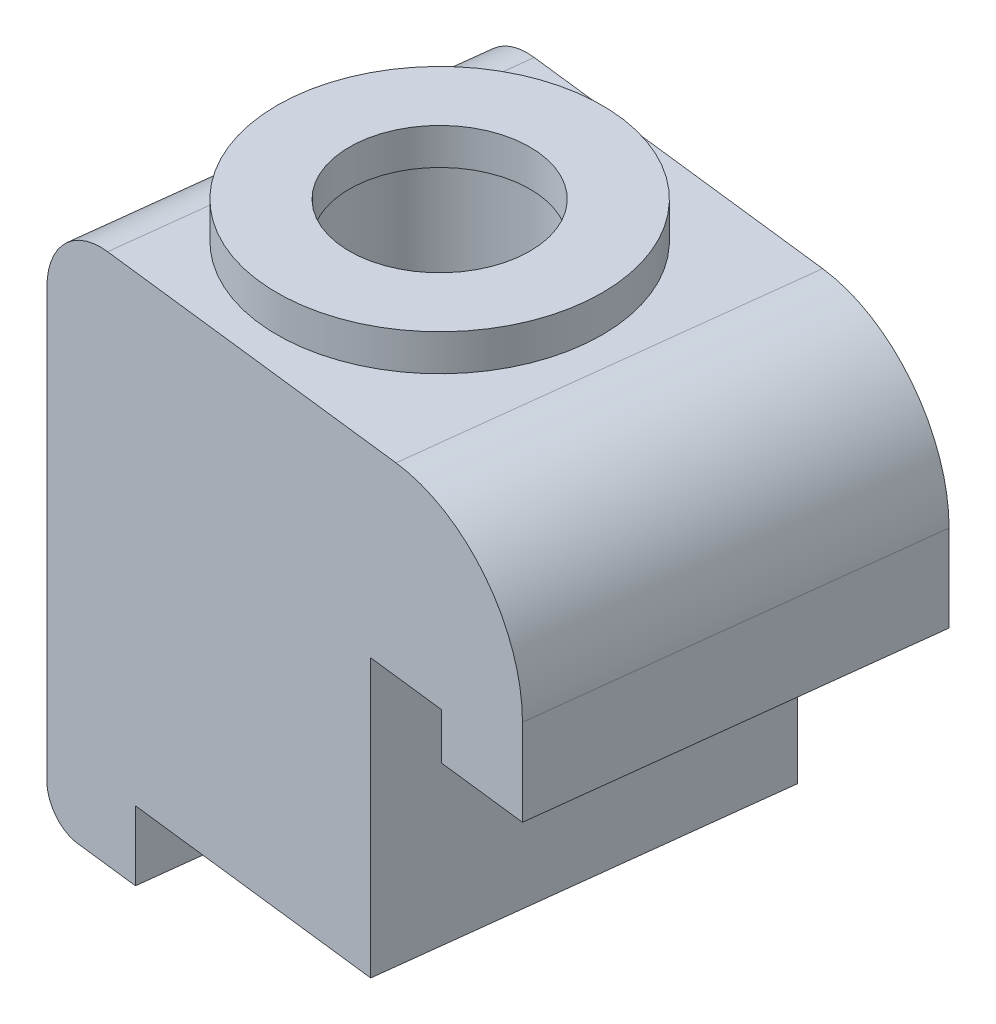
ISO-10303-21;
HEADER;
FILE_DESCRIPTION(('STEP AP214'),'2;1');
FILE_NAME('part.step','',(''),(''),'','','');
FILE_SCHEMA(('AUTOMOTIVE_DESIGN { 1 0 10303 214 1 1 1 1 }'));
ENDSEC;
DATA;
#1=APPLICATION_CONTEXT('core data for automotive mechanical design processes');
#2=APPLICATION_PROTOCOL_DEFINITION('international standard','automotive_design',2000,#1);
#3=PRODUCT_CONTEXT('',#1,'mechanical');
#4=PRODUCT('Part','Part','',(#3));
#5=PRODUCT_RELATED_PRODUCT_CATEGORY('part','',(#4));
#6=PRODUCT_DEFINITION_FORMATION('','',#4);
#7=PRODUCT_DEFINITION_CONTEXT('part definition',#1,'design');
#8=PRODUCT_DEFINITION('design','',#6,#7);
#9=PRODUCT_DEFINITION_SHAPE('','',#8);
#10=(LENGTH_UNIT() NAMED_UNIT(*) SI_UNIT(.MILLI.,.METRE.));
#11=(NAMED_UNIT(*) PLANE_ANGLE_UNIT() SI_UNIT($,.RADIAN.));
#12=(NAMED_UNIT(*) SI_UNIT($,.STERADIAN.) SOLID_ANGLE_UNIT());
#13=UNCERTAINTY_MEASURE_WITH_UNIT(LENGTH_MEASURE(1.E-05),#10,'distance_accuracy_value','');
#14=(GEOMETRIC_REPRESENTATION_CONTEXT(3) GLOBAL_UNCERTAINTY_ASSIGNED_CONTEXT((#13)) GLOBAL_UNIT_ASSIGNED_CONTEXT((#10,
#11,#12)) REPRESENTATION_CONTEXT('',''));
#15=CARTESIAN_POINT('',(0.,0.,0.));
#16=DIRECTION('',(0.,0.,1.));
#17=DIRECTION('',(1.,0.,0.));
#18=AXIS2_PLACEMENT_3D('',#15,#16,#17);
#19=CARTESIAN_POINT('',(8.99159999999999,3.5052,-8.45820000000003));
#20=DIRECTION('',(0.,1.,0.));
#21=DIRECTION('',(0.,0.,1.));
#22=AXIS2_PLACEMENT_3D('',#19,#20,#21);
#23=CYLINDRICAL_SURFACE('',#22,4.2164);
#24=CARTESIAN_POINT('',(8.99159999999998,23.8252,-8.45820000000002));
#25=DIRECTION('',(0.,1.,0.));
#26=DIRECTION('',(0.,0.,1.));
#27=AXIS2_PLACEMENT_3D('',#24,#25,#26);
#28=CIRCLE('',#27,4.2164);
#29=CARTESIAN_POINT('',(8.99159999999998,23.8252,-4.24180000000002));
#30=VERTEX_POINT('',#29);
#31=EDGE_CURVE('P0_E81',#30,#30,#28,.F.);
#32=ORIENTED_EDGE('',*,*,#31,.F.);
#33=EDGE_LOOP('',(#32));
#34=FACE_BOUND('',#33,.T.);
#35=CARTESIAN_POINT('',(8.99159999999999,3.5052,-8.45820000000003));
#36=DIRECTION('',(0.,1.,0.));
#37=DIRECTION('',(0.,0.,1.));
#38=AXIS2_PLACEMENT_3D('',#35,#36,#37);
#39=CIRCLE('',#38,4.2164);
#40=CARTESIAN_POINT('',(8.99159999999999,3.5052,-4.24180000000003));
#41=VERTEX_POINT('',#40);
#42=EDGE_CURVE('P0_E112',#41,#41,#39,.T.);
#43=ORIENTED_EDGE('',*,*,#42,.F.);
#44=EDGE_LOOP('',(#43));
#45=FACE_BOUND('',#44,.T.);
#46=ADVANCED_FACE('P0_F16',(#34,#45),#23,.F.);
#47=CARTESIAN_POINT('',(9.79738698784271,13.705787628866,0.154145886731655));
#48=DIRECTION('',(0.117394308661662,0.,-0.993085382177107));
#49=DIRECTION('',(-0.993085382177107,0.,-0.117394308661662));
#50=AXIS2_PLACEMENT_3D('',#47,#48,#49);
#51=PLANE('',#50);
#52=CARTESIAN_POINT('',(2.09615318097006,20.7772,-0.75623003343106));
#53=DIRECTION('',(-0.117394308661662,0.,0.993085382177107));
#54=DIRECTION('',(0.993085382177107,0.,0.117394308661662));
#55=AXIS2_PLACEMENT_3D('',#52,#53,#54);
#56=CIRCLE('',#55,3.048);
#57=CARTESIAN_POINT('',(-0.930771063905758,20.7772,-1.11404788623181));
#58=VERTEX_POINT('',#57);
#59=CARTESIAN_POINT('',(2.09615318097006,23.8252,-0.756230033431062));
#60=VERTEX_POINT('',#59);
#61=EDGE_CURVE('P0_E19',#58,#60,#56,.F.);
#62=ORIENTED_EDGE('',*,*,#61,.F.);
#63=DIRECTION('',(0.,1.,0.));
#64=VECTOR('',#63,1.);
#65=CARTESIAN_POINT('',(-0.930771063905756,0.457199999999997,-1.11404788623181));
#66=LINE('',#65,#64);
#67=CARTESIAN_POINT('',(-0.930771063905756,1.9812,-1.11404788623181));
#68=VERTEX_POINT('',#67);
#69=EDGE_CURVE('P0_E76',#68,#58,#66,.T.);
#70=ORIENTED_EDGE('',*,*,#69,.F.);
#71=CARTESIAN_POINT('',(0.582691058532155,1.98119999999999,-0.935138959831442));
#72=DIRECTION('',(-0.117394308661662,0.,0.993085382177107));
#73=DIRECTION('',(0.993085382177107,0.,0.117394308661662));
#74=AXIS2_PLACEMENT_3D('',#71,#72,#73);
#75=CIRCLE('',#74,1.524);
#76=CARTESIAN_POINT('',(0.582691058532154,0.457199999999994,-0.935138959831442));
#77=VERTEX_POINT('',#76);
#78=EDGE_CURVE('P0_E91',#77,#68,#75,.F.);
#79=ORIENTED_EDGE('',*,*,#78,.F.);
#80=DIRECTION('',(-0.993085382177107,0.,-0.117394308661662));
#81=VECTOR('',#80,1.);
#82=CARTESIAN_POINT('',(3.48349345987148,0.457199999999994,-0.592230184230727));
#83=LINE('',#82,#81);
#84=CARTESIAN_POINT('',(3.48349345987148,0.457199999999994,-0.592230184230726));
#85=VERTEX_POINT('',#84);
#86=EDGE_CURVE('P0_E97',#85,#77,#83,.T.);
#87=ORIENTED_EDGE('',*,*,#86,.F.);
#88=DIRECTION('',(0.,1.,0.));
#89=VECTOR('',#88,1.);
#90=CARTESIAN_POINT('',(3.48349345987148,3.5052,-0.592230184230727));
#91=LINE('',#90,#89);
#92=CARTESIAN_POINT('',(3.48349345987149,3.5052,-0.592230184230727));
#93=VERTEX_POINT('',#92);
#94=EDGE_CURVE('P0_E101',#93,#85,#91,.F.);
#95=ORIENTED_EDGE('',*,*,#94,.F.);
#96=DIRECTION('',(-0.993085382177107,0.,-0.117394308661662));
#97=VECTOR('',#96,1.);
#98=CARTESIAN_POINT('',(15.2128249087653,3.5052,0.794313995372158));
#99=LINE('',#98,#97);
#100=CARTESIAN_POINT('',(15.2128249087653,3.5052,0.79431399537216));
#101=VERTEX_POINT('',#100);
#102=EDGE_CURVE('P0_E105',#101,#93,#99,.T.);
#103=ORIENTED_EDGE('',*,*,#102,.F.);
#104=DIRECTION('',(0.,1.,0.));
#105=VECTOR('',#104,1.);
#106=CARTESIAN_POINT('',(15.2128249087653,15.6972,0.794313995372161));
#107=LINE('',#106,#105);
#108=CARTESIAN_POINT('',(15.2128249087653,15.6972,0.794313995372161));
#109=VERTEX_POINT('',#108);
#110=EDGE_CURVE('P0_E109',#109,#101,#107,.F.);
#111=ORIENTED_EDGE('',*,*,#110,.F.);
#112=DIRECTION('',(-0.993085382177107,0.,-0.117394308661662));
#113=VECTOR('',#112,1.);
#114=CARTESIAN_POINT('',(18.7442365277871,15.6972,1.21176815697303));
#115=LINE('',#114,#113);
#116=CARTESIAN_POINT('',(18.7442365277871,15.6972,1.21176815697303));
#117=VERTEX_POINT('',#116);
#118=EDGE_CURVE('P0_E114',#117,#109,#115,.T.);
#119=ORIENTED_EDGE('',*,*,#118,.F.);
#120=DIRECTION('',(0.,1.,0.));
#121=VECTOR('',#120,1.);
#122=CARTESIAN_POINT('',(18.7442365277871,13.6652,1.21176815697303));
#123=LINE('',#122,#121);
#124=CARTESIAN_POINT('',(18.7442365277871,13.6652,1.21176815697303));
#125=VERTEX_POINT('',#124);
#126=EDGE_CURVE('P0_E118',#125,#117,#123,.T.);
#127=ORIENTED_EDGE('',*,*,#126,.F.);
#128=DIRECTION('',(-0.993085382177107,0.,-0.117394308661662));
#129=VECTOR('',#128,1.);
#130=CARTESIAN_POINT('',(22.7801355209549,13.6652,1.68885862737402));
#131=LINE('',#130,#129);
#132=CARTESIAN_POINT('',(22.7801355209549,13.6652,1.68885862737402));
#133=VERTEX_POINT('',#132);
#134=EDGE_CURVE('P0_E122',#133,#125,#131,.T.);
#135=ORIENTED_EDGE('',*,*,#134,.F.);
#136=DIRECTION('',(0.,1.,0.));
#137=VECTOR('',#136,1.);
#138=CARTESIAN_POINT('',(22.7801355209549,23.8252,1.68885862737402));
#139=LINE('',#138,#137);
#140=CARTESIAN_POINT('',(22.7801355209549,17.4752,1.68885862737402));
#141=VERTEX_POINT('',#140);
#142=EDGE_CURVE('P0_E126',#141,#133,#139,.F.);
#143=ORIENTED_EDGE('',*,*,#142,.F.);
#144=CARTESIAN_POINT('',(16.4740433441302,17.4752,0.943404767372469));
#145=DIRECTION('',(-0.117394308661662,0.,0.993085382177107));
#146=DIRECTION('',(0.993085382177107,0.,0.117394308661662));
#147=AXIS2_PLACEMENT_3D('',#144,#145,#146);
#148=CIRCLE('',#147,6.35);
#149=CARTESIAN_POINT('',(16.4740433441302,23.8252,0.943404767372471));
#150=VERTEX_POINT('',#149);
#151=EDGE_CURVE('P0_E144',#150,#141,#148,.F.);
#152=ORIENTED_EDGE('',*,*,#151,.F.);
#153=DIRECTION('',(0.993085382177107,0.,0.117394308661662));
#154=VECTOR('',#153,1.);
#155=CARTESIAN_POINT('',(2.09615318097006,23.8252,-0.756230033431067));
#156=LINE('',#155,#154);
#157=EDGE_CURVE('P0_E78',#60,#150,#156,.T.);
#158=ORIENTED_EDGE('',*,*,#157,.F.);
#159=EDGE_LOOP('',(#62,#70,#79,#87,#95,#103,#111,#119,#127,#135,#143,#152,#158));
#160=FACE_BOUND('',#159,.T.);
#161=ADVANCED_FACE('P0_F73',(#160),#51,.F.);
#162=CARTESIAN_POINT('',(4.07906044857419,20.7772,-17.5304352237846));
#163=DIRECTION('',(-0.117394308661662,0.,0.993085382177107));
#164=DIRECTION('',(0.993085382177107,0.,0.117394308661662));
#165=AXIS2_PLACEMENT_3D('',#162,#163,#164);
#166=CYLINDRICAL_SURFACE('',#165,3.048);
#167=ORIENTED_EDGE('',*,*,#61,.T.);
#168=DIRECTION('',(-0.117394308661662,0.,0.993085382177107));
#169=VECTOR('',#168,1.);
#170=CARTESIAN_POINT('',(4.07906044857419,23.8252,-17.5304352237846));
#171=LINE('',#170,#169);
#172=CARTESIAN_POINT('',(4.07906044857419,23.8252,-17.5304352237846));
#173=VERTEX_POINT('',#172);
#174=EDGE_CURVE('P0_E95',#173,#60,#171,.T.);
#175=ORIENTED_EDGE('',*,*,#174,.F.);
#176=CARTESIAN_POINT('',(4.07906044857419,20.7772,-17.5304352237846));
#177=DIRECTION('',(-0.117394308661662,0.,0.993085382177107));
#178=DIRECTION('',(0.993085382177107,0.,0.117394308661662));
#179=AXIS2_PLACEMENT_3D('',#176,#177,#178);
#180=CIRCLE('',#179,3.048);
#181=CARTESIAN_POINT('',(1.05213620369837,20.7772,-17.8882530765853));
#182=VERTEX_POINT('',#181);
#183=EDGE_CURVE('P0_E86',#182,#173,#180,.F.);
#184=ORIENTED_EDGE('',*,*,#183,.F.);
#185=DIRECTION('',(-0.117394308661662,0.,0.993085382177107));
#186=VECTOR('',#185,1.);
#187=CARTESIAN_POINT('',(1.05213620369837,20.7772,-17.8882530765853));
#188=LINE('',#187,#186);
#189=EDGE_CURVE('P0_E83',#58,#182,#188,.F.);
#190=ORIENTED_EDGE('',*,*,#189,.F.);
#191=EDGE_LOOP('',(#167,#175,#184,#190));
#192=FACE_BOUND('',#191,.T.);
#193=ADVANCED_FACE('P0_F84',(#192),#166,.T.);
#194=CARTESIAN_POINT('',(1.05213620369837,23.8252,-17.8882530765853));
#195=DIRECTION('',(0.,1.,0.));
#196=DIRECTION('',(0.,0.,1.));
#197=AXIS2_PLACEMENT_3D('',#194,#195,#196);
#198=PLANE('',#197);
#199=DIRECTION('',(-0.117394308661662,0.,0.993085382177107));
#200=VECTOR('',#199,1.);
#201=CARTESIAN_POINT('',(18.4569506117343,23.8252,-15.830800422981));
#202=LINE('',#201,#200);
#203=CARTESIAN_POINT('',(18.4569506117343,23.8252,-15.830800422981));
#204=VERTEX_POINT('',#203);
#205=EDGE_CURVE('P0_E131',#204,#150,#202,.T.);
#206=ORIENTED_EDGE('',*,*,#205,.F.);
#207=DIRECTION('',(-0.993085382177107,0.,-0.117394308661662));
#208=VECTOR('',#207,1.);
#209=CARTESIAN_POINT('',(11.7802942554468,23.8252,-16.6200593036219));
#210=LINE('',#209,#208);
#211=EDGE_CURVE('P0_E139',#173,#204,#210,.F.);
#212=ORIENTED_EDGE('',*,*,#211,.F.);
#213=ORIENTED_EDGE('',*,*,#174,.T.);
#214=ORIENTED_EDGE('',*,*,#157,.T.);
#215=EDGE_LOOP('',(#206,#212,#213,#214));
#216=FACE_BOUND('',#215,.T.);
#217=ORIENTED_EDGE('',*,*,#31,.T.);
#218=EDGE_LOOP('',(#217));
#219=FACE_BOUND('',#218,.T.);
#220=ADVANCED_FACE('P0_F150',(#216,#219),#198,.T.);
#221=CARTESIAN_POINT('',(18.4569506117343,17.4752,-15.830800422981));
#222=DIRECTION('',(-0.117394308661662,0.,0.993085382177107));
#223=DIRECTION('',(0.993085382177107,0.,0.117394308661662));
#224=AXIS2_PLACEMENT_3D('',#221,#222,#223);
#225=CYLINDRICAL_SURFACE('',#224,6.35);
#226=ORIENTED_EDGE('',*,*,#151,.T.);
#227=DIRECTION('',(0.117394308661662,0.,-0.993085382177107));
#228=VECTOR('',#227,1.);
#229=CARTESIAN_POINT('',(24.763042788559,17.4752,-15.0853465629795));
#230=LINE('',#229,#228);
#231=CARTESIAN_POINT('',(24.763042788559,17.4752,-15.0853465629795));
#232=VERTEX_POINT('',#231);
#233=EDGE_CURVE('P0_E129',#232,#141,#230,.F.);
#234=ORIENTED_EDGE('',*,*,#233,.F.);
#235=CARTESIAN_POINT('',(18.4569506117343,17.4752,-15.830800422981));
#236=DIRECTION('',(-0.117394308661662,0.,0.993085382177107));
#237=DIRECTION('',(0.993085382177107,0.,0.117394308661662));
#238=AXIS2_PLACEMENT_3D('',#235,#236,#237);
#239=CIRCLE('',#238,6.35);
#240=EDGE_CURVE('P0_E135',#204,#232,#239,.F.);
#241=ORIENTED_EDGE('',*,*,#240,.F.);
#242=ORIENTED_EDGE('',*,*,#205,.T.);
#243=EDGE_LOOP('',(#226,#234,#241,#242));
#244=FACE_BOUND('',#243,.T.);
#245=ADVANCED_FACE('P0_F198',(#244),#225,.T.);
#246=CARTESIAN_POINT('',(24.763042788559,23.8252,-15.0853465629795));
#247=DIRECTION('',(0.993085382177107,0.,0.117394308661662));
#248=DIRECTION('',(0.117394308661662,0.,-0.993085382177107));
#249=AXIS2_PLACEMENT_3D('',#246,#247,#248);
#250=PLANE('',#249);
#251=ORIENTED_EDGE('',*,*,#233,.T.);
#252=ORIENTED_EDGE('',*,*,#142,.T.);
#253=DIRECTION('',(-0.117394308661662,0.,0.993085382177107));
#254=VECTOR('',#253,1.);
#255=CARTESIAN_POINT('',(24.763042788559,13.6652,-15.0853465629795));
#256=LINE('',#255,#254);
#257=CARTESIAN_POINT('',(24.763042788559,13.6652,-15.0853465629795));
#258=VERTEX_POINT('',#257);
#259=EDGE_CURVE('P0_E125',#258,#133,#256,.T.);
#260=ORIENTED_EDGE('',*,*,#259,.F.);
#261=DIRECTION('',(0.,1.,0.));
#262=VECTOR('',#261,1.);
#263=CARTESIAN_POINT('',(24.763042788559,13.705787628866,-15.0853465629795));
#264=LINE('',#263,#262);
#265=EDGE_CURVE('P0_E138',#232,#258,#264,.F.);
#266=ORIENTED_EDGE('',*,*,#265,.F.);
#267=EDGE_LOOP('',(#251,#252,#260,#266));
#268=FACE_BOUND('',#267,.T.);
#269=ADVANCED_FACE('P0_F209',(#268),#250,.T.);
#270=CARTESIAN_POINT('',(24.763042788559,13.6652,-15.0853465629795));
#271=DIRECTION('',(0.,-1.,0.));
#272=DIRECTION('',(0.,0.,-1.));
#273=AXIS2_PLACEMENT_3D('',#270,#271,#272);
#274=PLANE('',#273);
#275=ORIENTED_EDGE('',*,*,#134,.T.);
#276=DIRECTION('',(-0.117394308661662,0.,0.993085382177107));
#277=VECTOR('',#276,1.);
#278=CARTESIAN_POINT('',(20.7271437953912,13.6652,-15.5624370333805));
#279=LINE('',#278,#277);
#280=CARTESIAN_POINT('',(20.7271437953912,13.6652,-15.5624370333805));
#281=VERTEX_POINT('',#280);
#282=EDGE_CURVE('P0_E121',#281,#125,#279,.T.);
#283=ORIENTED_EDGE('',*,*,#282,.F.);
#284=DIRECTION('',(-0.993085382177107,0.,-0.117394308661662));
#285=VECTOR('',#284,1.);
#286=CARTESIAN_POINT('',(11.7802942554468,13.6652,-16.6200593036219));
#287=LINE('',#286,#285);
#288=EDGE_CURVE('P0_E189',#258,#281,#287,.T.);
#289=ORIENTED_EDGE('',*,*,#288,.F.);
#290=ORIENTED_EDGE('',*,*,#259,.T.);
#291=EDGE_LOOP('',(#275,#283,#289,#290));
#292=FACE_BOUND('',#291,.T.);
#293=ADVANCED_FACE('P0_F213',(#292),#274,.T.);
#294=CARTESIAN_POINT('',(20.7271437953912,13.6652,-15.5624370333805));
#295=DIRECTION('',(-0.993085382177107,0.,-0.117394308661662));
#296=DIRECTION('',(-0.117394308661662,0.,0.993085382177107));
#297=AXIS2_PLACEMENT_3D('',#294,#295,#296);
#298=PLANE('',#297);
#299=ORIENTED_EDGE('',*,*,#126,.T.);
#300=DIRECTION('',(-0.117394308661662,0.,0.993085382177107));
#301=VECTOR('',#300,1.);
#302=CARTESIAN_POINT('',(20.7271437953912,15.6972,-15.5624370333805));
#303=LINE('',#302,#301);
#304=CARTESIAN_POINT('',(20.7271437953912,15.6972,-15.5624370333805));
#305=VERTEX_POINT('',#304);
#306=EDGE_CURVE('P0_E117',#305,#117,#303,.T.);
#307=ORIENTED_EDGE('',*,*,#306,.F.);
#308=DIRECTION('',(0.,1.,0.));
#309=VECTOR('',#308,1.);
#310=CARTESIAN_POINT('',(20.7271437953912,13.705787628866,-15.5624370333805));
#311=LINE('',#310,#309);
#312=EDGE_CURVE('P0_E184',#281,#305,#311,.T.);
#313=ORIENTED_EDGE('',*,*,#312,.F.);
#314=ORIENTED_EDGE('',*,*,#282,.T.);
#315=EDGE_LOOP('',(#299,#307,#313,#314));
#316=FACE_BOUND('',#315,.T.);
#317=ADVANCED_FACE('P0_F221',(#316),#298,.T.);
#318=CARTESIAN_POINT('',(20.7271437953912,15.6972,-15.5624370333805));
#319=DIRECTION('',(0.,-1.,0.));
#320=DIRECTION('',(0.,0.,-1.));
#321=AXIS2_PLACEMENT_3D('',#318,#319,#320);
#322=PLANE('',#321);
#323=ORIENTED_EDGE('',*,*,#118,.T.);
#324=DIRECTION('',(0.117394308661662,0.,-0.993085382177107));
#325=VECTOR('',#324,1.);
#326=CARTESIAN_POINT('',(17.1957321763694,15.6972,-15.9798911949814));
#327=LINE('',#326,#325);
#328=CARTESIAN_POINT('',(17.1957321763694,15.6972,-15.9798911949814));
#329=VERTEX_POINT('',#328);
#330=EDGE_CURVE('P0_E113',#329,#109,#327,.F.);
#331=ORIENTED_EDGE('',*,*,#330,.F.);
#332=DIRECTION('',(-0.993085382177107,0.,-0.117394308661662));
#333=VECTOR('',#332,1.);
#334=CARTESIAN_POINT('',(11.7802942554468,15.6972,-16.6200593036219));
#335=LINE('',#334,#333);
#336=EDGE_CURVE('P0_E179',#305,#329,#335,.T.);
#337=ORIENTED_EDGE('',*,*,#336,.F.);
#338=ORIENTED_EDGE('',*,*,#306,.T.);
#339=EDGE_LOOP('',(#323,#331,#337,#338));
#340=FACE_BOUND('',#339,.T.);
#341=ADVANCED_FACE('P0_F262',(#340),#322,.T.);
#342=CARTESIAN_POINT('',(17.1957321763694,15.6972,-15.9798911949814));
#343=DIRECTION('',(0.993085382177107,0.,0.117394308661662));
#344=DIRECTION('',(0.117394308661662,0.,-0.993085382177107));
#345=AXIS2_PLACEMENT_3D('',#342,#343,#344);
#346=PLANE('',#345);
#347=ORIENTED_EDGE('',*,*,#110,.T.);
#348=DIRECTION('',(-0.117394308661662,0.,0.993085382177107));
#349=VECTOR('',#348,1.);
#350=CARTESIAN_POINT('',(17.1957321763694,3.5052,-15.9798911949814));
#351=LINE('',#350,#349);
#352=CARTESIAN_POINT('',(17.1957321763694,3.5052,-15.9798911949814));
#353=VERTEX_POINT('',#352);
#354=EDGE_CURVE('P0_E108',#353,#101,#351,.T.);
#355=ORIENTED_EDGE('',*,*,#354,.F.);
#356=DIRECTION('',(0.,1.,0.));
#357=VECTOR('',#356,1.);
#358=CARTESIAN_POINT('',(17.1957321763694,13.705787628866,-15.9798911949814));
#359=LINE('',#358,#357);
#360=EDGE_CURVE('P0_E174',#329,#353,#359,.F.);
#361=ORIENTED_EDGE('',*,*,#360,.F.);
#362=ORIENTED_EDGE('',*,*,#330,.T.);
#363=EDGE_LOOP('',(#347,#355,#361,#362));
#364=FACE_BOUND('',#363,.T.);
#365=ADVANCED_FACE('P0_F261',(#364),#346,.T.);
#366=CARTESIAN_POINT('',(17.1957321763694,3.5052,-15.9798911949814));
#367=DIRECTION('',(0.,-1.,0.));
#368=DIRECTION('',(0.,0.,-1.));
#369=AXIS2_PLACEMENT_3D('',#366,#367,#368);
#370=PLANE('',#369);
#371=ORIENTED_EDGE('',*,*,#102,.T.);
#372=DIRECTION('',(0.117394308661662,0.,-0.993085382177107));
#373=VECTOR('',#372,1.);
#374=CARTESIAN_POINT('',(5.46640072747561,3.5052,-17.3664353745842));
#375=LINE('',#374,#373);
#376=CARTESIAN_POINT('',(5.46640072747561,3.5052,-17.3664353745842));
#377=VERTEX_POINT('',#376);
#378=EDGE_CURVE('P0_E104',#377,#93,#375,.F.);
#379=ORIENTED_EDGE('',*,*,#378,.F.);
#380=DIRECTION('',(-0.993085382177107,0.,-0.117394308661662));
#381=VECTOR('',#380,1.);
#382=CARTESIAN_POINT('',(11.7802942554468,3.5052,-16.6200593036219));
#383=LINE('',#382,#381);
#384=EDGE_CURVE('P0_E169',#353,#377,#383,.T.);
#385=ORIENTED_EDGE('',*,*,#384,.F.);
#386=ORIENTED_EDGE('',*,*,#354,.T.);
#387=EDGE_LOOP('',(#371,#379,#385,#386));
#388=FACE_BOUND('',#387,.T.);
#389=ORIENTED_EDGE('',*,*,#42,.T.);
#390=EDGE_LOOP('',(#389));
#391=FACE_BOUND('',#390,.T.);
#392=ADVANCED_FACE('P0_F259',(#388,#391),#370,.T.);
#393=CARTESIAN_POINT('',(5.46640072747561,3.5052,-17.3664353745842));
#394=DIRECTION('',(0.993085382177107,0.,0.117394308661662));
#395=DIRECTION('',(0.117394308661662,0.,-0.993085382177107));
#396=AXIS2_PLACEMENT_3D('',#393,#394,#395);
#397=PLANE('',#396);
#398=ORIENTED_EDGE('',*,*,#94,.T.);
#399=DIRECTION('',(-0.117394308661662,0.,0.993085382177107));
#400=VECTOR('',#399,1.);
#401=CARTESIAN_POINT('',(5.46640072747561,0.457199999999997,-17.3664353745842));
#402=LINE('',#401,#400);
#403=CARTESIAN_POINT('',(5.46640072747561,0.457199999999998,-17.3664353745842));
#404=VERTEX_POINT('',#403);
#405=EDGE_CURVE('P0_E100',#404,#85,#402,.T.);
#406=ORIENTED_EDGE('',*,*,#405,.F.);
#407=DIRECTION('',(0.,1.,0.));
#408=VECTOR('',#407,1.);
#409=CARTESIAN_POINT('',(5.46640072747561,13.705787628866,-17.3664353745842));
#410=LINE('',#409,#408);
#411=EDGE_CURVE('P0_E167',#377,#404,#410,.F.);
#412=ORIENTED_EDGE('',*,*,#411,.F.);
#413=ORIENTED_EDGE('',*,*,#378,.T.);
#414=EDGE_LOOP('',(#398,#406,#412,#413));
#415=FACE_BOUND('',#414,.T.);
#416=ADVANCED_FACE('P0_F252',(#415),#397,.T.);
#417=CARTESIAN_POINT('',(5.46640072747561,0.457199999999997,-17.3664353745842));
#418=DIRECTION('',(0.,-1.,0.));
#419=DIRECTION('',(0.,0.,-1.));
#420=AXIS2_PLACEMENT_3D('',#417,#418,#419);
#421=PLANE('',#420);
#422=DIRECTION('',(-0.117394308661662,0.,0.993085382177107));
#423=VECTOR('',#422,1.);
#424=CARTESIAN_POINT('',(2.56559832613628,0.457199999999997,-17.709344150185));
#425=LINE('',#424,#423);
#426=CARTESIAN_POINT('',(2.56559832613628,0.457199999999997,-17.709344150185));
#427=VERTEX_POINT('',#426);
#428=EDGE_CURVE('P0_E99',#427,#77,#425,.T.);
#429=ORIENTED_EDGE('',*,*,#428,.F.);
#430=DIRECTION('',(-0.993085382177107,0.,-0.117394308661662));
#431=VECTOR('',#430,1.);
#432=CARTESIAN_POINT('',(11.7802942554468,0.457199999999998,-16.6200593036219));
#433=LINE('',#432,#431);
#434=EDGE_CURVE('P0_E134',#404,#427,#433,.T.);
#435=ORIENTED_EDGE('',*,*,#434,.F.);
#436=ORIENTED_EDGE('',*,*,#405,.T.);
#437=ORIENTED_EDGE('',*,*,#86,.T.);
#438=EDGE_LOOP('',(#429,#435,#436,#437));
#439=FACE_BOUND('',#438,.T.);
#440=ADVANCED_FACE('P0_F255',(#439),#421,.T.);
#441=CARTESIAN_POINT('',(2.56559832613628,1.9812,-17.709344150185));
#442=DIRECTION('',(-0.117394308661662,0.,0.993085382177107));
#443=DIRECTION('',(0.993085382177107,0.,0.117394308661662));
#444=AXIS2_PLACEMENT_3D('',#441,#442,#443);
#445=CYLINDRICAL_SURFACE('',#444,1.524);
#446=ORIENTED_EDGE('',*,*,#78,.T.);
#447=DIRECTION('',(-0.117394308661662,0.,0.993085382177107));
#448=VECTOR('',#447,1.);
#449=CARTESIAN_POINT('',(1.05213620369837,1.9812,-17.8882530765853));
#450=LINE('',#449,#448);
#451=CARTESIAN_POINT('',(1.05213620369837,1.9812,-17.8882530765853));
#452=VERTEX_POINT('',#451);
#453=EDGE_CURVE('P0_E34',#452,#68,#450,.T.);
#454=ORIENTED_EDGE('',*,*,#453,.F.);
#455=CARTESIAN_POINT('',(2.56559832613628,1.9812,-17.709344150185));
#456=DIRECTION('',(-0.117394308661662,0.,0.993085382177107));
#457=DIRECTION('',(0.993085382177107,0.,0.117394308661662));
#458=AXIS2_PLACEMENT_3D('',#455,#456,#457);
#459=CIRCLE('',#458,1.524);
#460=EDGE_CURVE('P0_E25',#427,#452,#459,.F.);
#461=ORIENTED_EDGE('',*,*,#460,.F.);
#462=ORIENTED_EDGE('',*,*,#428,.T.);
#463=EDGE_LOOP('',(#446,#454,#461,#462));
#464=FACE_BOUND('',#463,.T.);
#465=ADVANCED_FACE('P0_F161',(#464),#445,.T.);
#466=CARTESIAN_POINT('',(1.05213620369837,0.457199999999997,-17.8882530765853));
#467=DIRECTION('',(-0.993085382177107,0.,-0.117394308661662));
#468=DIRECTION('',(-0.117394308661662,0.,0.993085382177107));
#469=AXIS2_PLACEMENT_3D('',#466,#467,#468);
#470=PLANE('',#469);
#471=ORIENTED_EDGE('',*,*,#189,.T.);
#472=DIRECTION('',(0.,1.,0.));
#473=VECTOR('',#472,1.);
#474=CARTESIAN_POINT('',(1.05213620369837,13.705787628866,-17.8882530765853));
#475=LINE('',#474,#473);
#476=EDGE_CURVE('P0_E11',#452,#182,#475,.T.);
#477=ORIENTED_EDGE('',*,*,#476,.F.);
#478=ORIENTED_EDGE('',*,*,#453,.T.);
#479=ORIENTED_EDGE('',*,*,#69,.T.);
#480=EDGE_LOOP('',(#471,#477,#478,#479));
#481=FACE_BOUND('',#480,.T.);
#482=ADVANCED_FACE('P0_F89',(#481),#470,.T.);
#483=CARTESIAN_POINT('',(11.7802942554468,13.705787628866,-16.6200593036219));
#484=DIRECTION('',(0.117394308661662,0.,-0.993085382177107));
#485=DIRECTION('',(-0.993085382177107,0.,-0.117394308661662));
#486=AXIS2_PLACEMENT_3D('',#483,#484,#485);
#487=PLANE('',#486);
#488=ORIENTED_EDGE('',*,*,#460,.T.);
#489=ORIENTED_EDGE('',*,*,#476,.T.);
#490=ORIENTED_EDGE('',*,*,#183,.T.);
#491=ORIENTED_EDGE('',*,*,#211,.T.);
#492=ORIENTED_EDGE('',*,*,#240,.T.);
#493=ORIENTED_EDGE('',*,*,#265,.T.);
#494=ORIENTED_EDGE('',*,*,#288,.T.);
#495=ORIENTED_EDGE('',*,*,#312,.T.);
#496=ORIENTED_EDGE('',*,*,#336,.T.);
#497=ORIENTED_EDGE('',*,*,#360,.T.);
#498=ORIENTED_EDGE('',*,*,#384,.T.);
#499=ORIENTED_EDGE('',*,*,#411,.T.);
#500=ORIENTED_EDGE('',*,*,#434,.T.);
#501=EDGE_LOOP('',(#488,#489,#490,#491,#492,#493,#494,#495,#496,#497,#498,#499,#500));
#502=FACE_BOUND('',#501,.T.);
#503=ADVANCED_FACE('P0_F156',(#502),#487,.T.);
#504=CLOSED_SHELL('',(#46,#161,#193,#220,#245,#269,#293,#317,#341,#365,#392,#416,#440,#465,#482,#503));
#505=MANIFOLD_SOLID_BREP('P0_B1',#504);
#506=CARTESIAN_POINT('',(8.9916,25.4254,-8.4582));
#507=DIRECTION('',(0.,-1.,0.));
#508=DIRECTION('',(1.,0.,0.));
#509=AXIS2_PLACEMENT_3D('',#506,#507,#508);
#510=PLANE('',#509);
#511=CARTESIAN_POINT('',(8.9916,25.4254,-8.4582));
#512=DIRECTION('',(0.,-1.,0.));
#513=DIRECTION('',(1.,0.,0.));
#514=AXIS2_PLACEMENT_3D('',#511,#512,#513);
#515=CIRCLE('',#514,7.14375);
#516=CARTESIAN_POINT('',(16.13535,25.4254,-8.4582));
#517=VERTEX_POINT('',#516);
#518=EDGE_CURVE('P1_E26',#517,#517,#515,.T.);
#519=ORIENTED_EDGE('',*,*,#518,.F.);
#520=EDGE_LOOP('',(#519));
#521=FACE_BOUND('',#520,.T.);
#522=CARTESIAN_POINT('',(8.9916,25.4254,-8.4582));
#523=DIRECTION('',(0.,-1.,0.));
#524=DIRECTION('',(1.,0.,0.));
#525=AXIS2_PLACEMENT_3D('',#522,#523,#524);
#526=CIRCLE('',#525,3.96875);
#527=CARTESIAN_POINT('',(12.96035,25.4254,-8.4582));
#528=VERTEX_POINT('',#527);
#529=EDGE_CURVE('P1_E17',#528,#528,#526,.T.);
#530=ORIENTED_EDGE('',*,*,#529,.T.);
#531=EDGE_LOOP('',(#530));
#532=FACE_BOUND('',#531,.T.);
#533=ADVANCED_FACE('P1_F14',(#521,#532),#510,.F.);
#534=CARTESIAN_POINT('',(8.9916,25.4254,-8.4582));
#535=DIRECTION('',(0.,-1.,0.));
#536=DIRECTION('',(1.,0.,0.));
#537=AXIS2_PLACEMENT_3D('',#534,#535,#536);
#538=CYLINDRICAL_SURFACE('',#537,3.96875);
#539=ORIENTED_EDGE('',*,*,#529,.F.);
#540=EDGE_LOOP('',(#539));
#541=FACE_BOUND('',#540,.T.);
#542=CARTESIAN_POINT('',(8.9916,23.8252,-8.4582));
#543=DIRECTION('',(0.,-1.,0.));
#544=DIRECTION('',(1.,0.,0.));
#545=AXIS2_PLACEMENT_3D('',#542,#543,#544);
#546=CIRCLE('',#545,3.96875);
#547=CARTESIAN_POINT('',(12.96035,23.8252,-8.4582));
#548=VERTEX_POINT('',#547);
#549=EDGE_CURVE('P1_E21',#548,#548,#546,.F.);
#550=ORIENTED_EDGE('',*,*,#549,.F.);
#551=EDGE_LOOP('',(#550));
#552=FACE_BOUND('',#551,.T.);
#553=ADVANCED_FACE('P1_F35',(#541,#552),#538,.F.);
#554=CARTESIAN_POINT('',(8.9916,25.4254,-8.4582));
#555=DIRECTION('',(0.,-1.,0.));
#556=DIRECTION('',(1.,0.,0.));
#557=AXIS2_PLACEMENT_3D('',#554,#555,#556);
#558=CYLINDRICAL_SURFACE('',#557,7.14375);
#559=CARTESIAN_POINT('',(8.9916,23.8252,-8.4582));
#560=DIRECTION('',(0.,-1.,0.));
#561=DIRECTION('',(1.,0.,0.));
#562=AXIS2_PLACEMENT_3D('',#559,#560,#561);
#563=CIRCLE('',#562,7.14375);
#564=CARTESIAN_POINT('',(16.13535,23.8252,-8.4582));
#565=VERTEX_POINT('',#564);
#566=EDGE_CURVE('P1_E10',#565,#565,#563,.T.);
#567=ORIENTED_EDGE('',*,*,#566,.F.);
#568=EDGE_LOOP('',(#567));
#569=FACE_BOUND('',#568,.T.);
#570=ORIENTED_EDGE('',*,*,#518,.T.);
#571=EDGE_LOOP('',(#570));
#572=FACE_BOUND('',#571,.T.);
#573=ADVANCED_FACE('P1_F38',(#569,#572),#558,.T.);
#574=CARTESIAN_POINT('',(8.9916,23.8252,-8.4582));
#575=DIRECTION('',(0.,-1.,0.));
#576=DIRECTION('',(1.,0.,0.));
#577=AXIS2_PLACEMENT_3D('',#574,#575,#576);
#578=PLANE('',#577);
#579=ORIENTED_EDGE('',*,*,#566,.T.);
#580=EDGE_LOOP('',(#579));
#581=FACE_BOUND('',#580,.T.);
#582=ORIENTED_EDGE('',*,*,#549,.T.);
#583=EDGE_LOOP('',(#582));
#584=FACE_BOUND('',#583,.T.);
#585=ADVANCED_FACE('P1_F41',(#581,#584),#578,.T.);
#586=CLOSED_SHELL('',(#533,#553,#573,#585));
#587=MANIFOLD_SOLID_BREP('P1_B1',#586);
#588=ADVANCED_BREP_SHAPE_REPRESENTATION('',(#18,#505,#587),#14);
#589=SHAPE_DEFINITION_REPRESENTATION(#9,#588);
ENDSEC;
END-ISO-10303-21;
